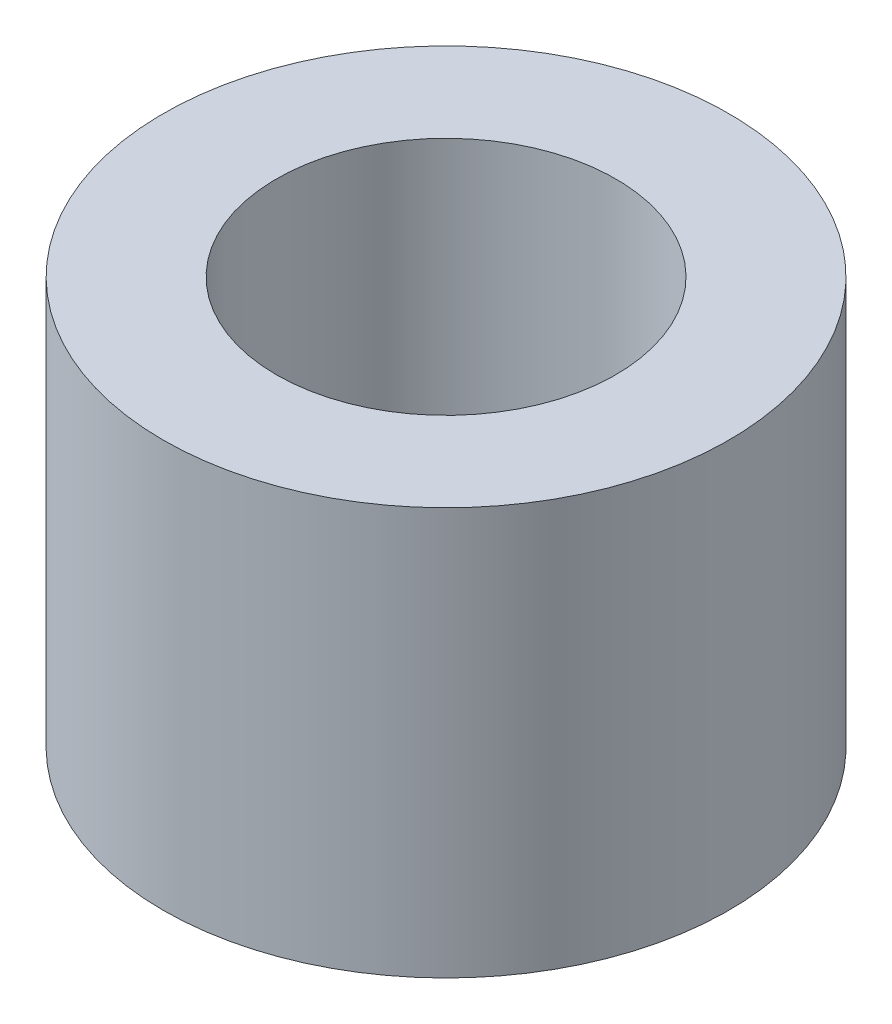
ISO-10303-21;
HEADER;
FILE_DESCRIPTION(('STEP AP214'),'2;1');
FILE_NAME('part.step','',(''),(''),'','','');
FILE_SCHEMA(('AUTOMOTIVE_DESIGN { 1 0 10303 214 1 1 1 1 }'));
ENDSEC;
DATA;
#1=APPLICATION_CONTEXT('core data for automotive mechanical design processes');
#2=APPLICATION_PROTOCOL_DEFINITION('international standard','automotive_design',2000,#1);
#3=PRODUCT_CONTEXT('',#1,'mechanical');
#4=PRODUCT('Part','Part','',(#3));
#5=PRODUCT_RELATED_PRODUCT_CATEGORY('part','',(#4));
#6=PRODUCT_DEFINITION_FORMATION('','',#4);
#7=PRODUCT_DEFINITION_CONTEXT('part definition',#1,'design');
#8=PRODUCT_DEFINITION('design','',#6,#7);
#9=PRODUCT_DEFINITION_SHAPE('','',#8);
#10=(LENGTH_UNIT() NAMED_UNIT(*) SI_UNIT(.MILLI.,.METRE.));
#11=(NAMED_UNIT(*) PLANE_ANGLE_UNIT() SI_UNIT($,.RADIAN.));
#12=(NAMED_UNIT(*) SI_UNIT($,.STERADIAN.) SOLID_ANGLE_UNIT());
#13=UNCERTAINTY_MEASURE_WITH_UNIT(LENGTH_MEASURE(1.E-05),#10,'distance_accuracy_value','');
#14=(GEOMETRIC_REPRESENTATION_CONTEXT(3) GLOBAL_UNCERTAINTY_ASSIGNED_CONTEXT((#13)) GLOBAL_UNIT_ASSIGNED_CONTEXT((#10,
#11,#12)) REPRESENTATION_CONTEXT('',''));
#15=CARTESIAN_POINT('',(0.,0.,0.));
#16=DIRECTION('',(0.,0.,1.));
#17=DIRECTION('',(1.,0.,0.));
#18=AXIS2_PLACEMENT_3D('',#15,#16,#17);
#19=CARTESIAN_POINT('',(0.,1.8,0.));
#20=DIRECTION('',(0.,1.,0.));
#21=DIRECTION('',(0.,0.,1.));
#22=AXIS2_PLACEMENT_3D('',#19,#20,#21);
#23=PLANE('',#22);
#24=CARTESIAN_POINT('',(0.,1.8,0.));
#25=DIRECTION('',(0.,1.,0.));
#26=DIRECTION('',(0.,0.,1.));
#27=AXIS2_PLACEMENT_3D('',#24,#25,#26);
#28=CIRCLE('',#27,1.25);
#29=CARTESIAN_POINT('',(0.,1.8,1.25));
#30=VERTEX_POINT('',#29);
#31=EDGE_CURVE('E10',#30,#30,#28,.T.);
#32=ORIENTED_EDGE('',*,*,#31,.T.);
#33=EDGE_LOOP('',(#32));
#34=FACE_BOUND('',#33,.T.);
#35=CARTESIAN_POINT('',(0.,1.8,0.));
#36=DIRECTION('',(0.,1.,0.));
#37=DIRECTION('',(0.,0.,1.));
#38=AXIS2_PLACEMENT_3D('',#35,#36,#37);
#39=CIRCLE('',#38,0.75);
#40=CARTESIAN_POINT('',(0.,1.8,0.75));
#41=VERTEX_POINT('',#40);
#42=EDGE_CURVE('E43',#41,#41,#39,.T.);
#43=ORIENTED_EDGE('',*,*,#42,.F.);
#44=EDGE_LOOP('',(#43));
#45=FACE_BOUND('',#44,.T.);
#46=ADVANCED_FACE('F32',(#34,#45),#23,.T.);
#47=CARTESIAN_POINT('',(0.,0.,0.));
#48=DIRECTION('',(0.,1.,0.));
#49=DIRECTION('',(0.,0.,1.));
#50=AXIS2_PLACEMENT_3D('',#47,#48,#49);
#51=PLANE('',#50);
#52=CARTESIAN_POINT('',(0.,0.,0.));
#53=DIRECTION('',(0.,1.,0.));
#54=DIRECTION('',(0.,0.,1.));
#55=AXIS2_PLACEMENT_3D('',#52,#53,#54);
#56=CIRCLE('',#55,1.25);
#57=CARTESIAN_POINT('',(0.,0.,1.25));
#58=VERTEX_POINT('',#57);
#59=EDGE_CURVE('E36',#58,#58,#56,.T.);
#60=ORIENTED_EDGE('',*,*,#59,.F.);
#61=EDGE_LOOP('',(#60));
#62=FACE_BOUND('',#61,.T.);
#63=CARTESIAN_POINT('',(0.,0.,0.));
#64=DIRECTION('',(0.,1.,0.));
#65=DIRECTION('',(0.,0.,1.));
#66=AXIS2_PLACEMENT_3D('',#63,#64,#65);
#67=CIRCLE('',#66,0.75);
#68=CARTESIAN_POINT('',(0.,0.,0.75));
#69=VERTEX_POINT('',#68);
#70=EDGE_CURVE('E45',#69,#69,#67,.T.);
#71=ORIENTED_EDGE('',*,*,#70,.T.);
#72=EDGE_LOOP('',(#71));
#73=FACE_BOUND('',#72,.T.);
#74=ADVANCED_FACE('F55',(#62,#73),#51,.F.);
#75=CARTESIAN_POINT('',(0.,1.8,0.));
#76=DIRECTION('',(0.,-1.,0.));
#77=DIRECTION('',(0.,0.,-1.));
#78=AXIS2_PLACEMENT_3D('',#75,#76,#77);
#79=CYLINDRICAL_SURFACE('',#78,1.25);
#80=ORIENTED_EDGE('',*,*,#31,.F.);
#81=EDGE_LOOP('',(#80));
#82=FACE_BOUND('',#81,.T.);
#83=ORIENTED_EDGE('',*,*,#59,.T.);
#84=EDGE_LOOP('',(#83));
#85=FACE_BOUND('',#84,.T.);
#86=ADVANCED_FACE('F34',(#82,#85),#79,.T.);
#87=CARTESIAN_POINT('',(0.,1.8,0.));
#88=DIRECTION('',(0.,-1.,0.));
#89=DIRECTION('',(0.,0.,-1.));
#90=AXIS2_PLACEMENT_3D('',#87,#88,#89);
#91=CYLINDRICAL_SURFACE('',#90,0.75);
#92=ORIENTED_EDGE('',*,*,#42,.T.);
#93=EDGE_LOOP('',(#92));
#94=FACE_BOUND('',#93,.T.);
#95=ORIENTED_EDGE('',*,*,#70,.F.);
#96=EDGE_LOOP('',(#95));
#97=FACE_BOUND('',#96,.T.);
#98=ADVANCED_FACE('F51',(#94,#97),#91,.F.);
#99=CLOSED_SHELL('',(#46,#74,#86,#98));
#100=MANIFOLD_SOLID_BREP('B2',#99);
#101=ADVANCED_BREP_SHAPE_REPRESENTATION('',(#18,#100),#14);
#102=SHAPE_DEFINITION_REPRESENTATION(#9,#101);
ENDSEC;
END-ISO-10303-21;
